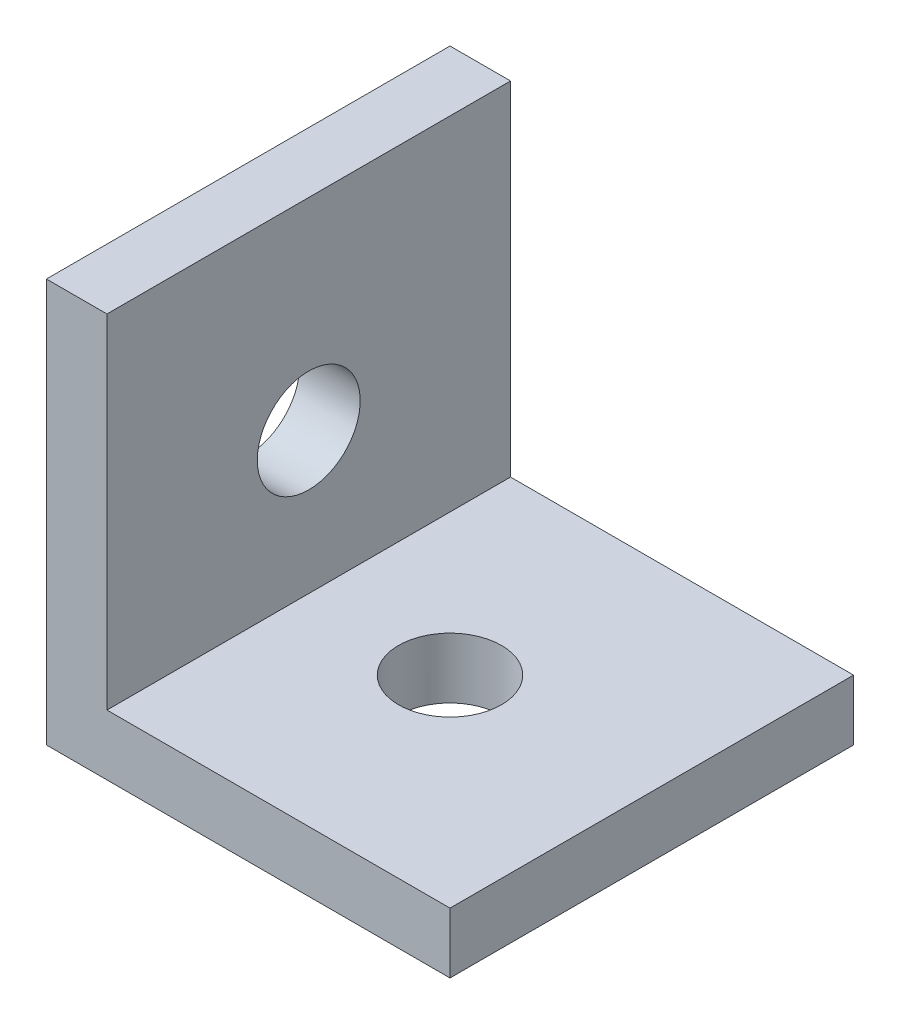
ISO-10303-21;
HEADER;
FILE_DESCRIPTION(('STEP AP214'),'2;1');
FILE_NAME('part.step','',(''),(''),'','','');
FILE_SCHEMA(('AUTOMOTIVE_DESIGN { 1 0 10303 214 1 1 1 1 }'));
ENDSEC;
DATA;
#1=APPLICATION_CONTEXT('core data for automotive mechanical design processes');
#2=APPLICATION_PROTOCOL_DEFINITION('international standard','automotive_design',2000,#1);
#3=PRODUCT_CONTEXT('',#1,'mechanical');
#4=PRODUCT('Part','Part','',(#3));
#5=PRODUCT_RELATED_PRODUCT_CATEGORY('part','',(#4));
#6=PRODUCT_DEFINITION_FORMATION('','',#4);
#7=PRODUCT_DEFINITION_CONTEXT('part definition',#1,'design');
#8=PRODUCT_DEFINITION('design','',#6,#7);
#9=PRODUCT_DEFINITION_SHAPE('','',#8);
#10=(LENGTH_UNIT() NAMED_UNIT(*) SI_UNIT(.MILLI.,.METRE.));
#11=(NAMED_UNIT(*) PLANE_ANGLE_UNIT() SI_UNIT($,.RADIAN.));
#12=(NAMED_UNIT(*) SI_UNIT($,.STERADIAN.) SOLID_ANGLE_UNIT());
#13=UNCERTAINTY_MEASURE_WITH_UNIT(LENGTH_MEASURE(1.E-05),#10,'distance_accuracy_value','');
#14=(GEOMETRIC_REPRESENTATION_CONTEXT(3) GLOBAL_UNCERTAINTY_ASSIGNED_CONTEXT((#13)) GLOBAL_UNIT_ASSIGNED_CONTEXT((#10,
#11,#12)) REPRESENTATION_CONTEXT('',''));
#15=CARTESIAN_POINT('',(0.,0.,0.));
#16=DIRECTION('',(0.,0.,1.));
#17=DIRECTION('',(1.,0.,0.));
#18=AXIS2_PLACEMENT_3D('',#15,#16,#17);
#19=CARTESIAN_POINT('',(0.,20.,20.));
#20=DIRECTION('',(0.,-1.,0.));
#21=DIRECTION('',(0.,0.,-1.));
#22=AXIS2_PLACEMENT_3D('',#19,#20,#21);
#23=PLANE('',#22);
#24=DIRECTION('',(-1.,0.,0.));
#25=VECTOR('',#24,1.);
#26=CARTESIAN_POINT('',(0.,20.,0.));
#27=LINE('',#26,#25);
#28=CARTESIAN_POINT('',(3.,20.,0.));
#29=VERTEX_POINT('',#28);
#30=CARTESIAN_POINT('',(0.,20.,0.));
#31=VERTEX_POINT('',#30);
#32=EDGE_CURVE('E118',#29,#31,#27,.T.);
#33=ORIENTED_EDGE('',*,*,#32,.T.);
#34=DIRECTION('',(0.,0.,-1.));
#35=VECTOR('',#34,1.);
#36=CARTESIAN_POINT('',(0.,20.,20.));
#37=LINE('',#36,#35);
#38=CARTESIAN_POINT('',(0.,20.,20.));
#39=VERTEX_POINT('',#38);
#40=EDGE_CURVE('E11',#39,#31,#37,.T.);
#41=ORIENTED_EDGE('',*,*,#40,.F.);
#42=DIRECTION('',(-1.,0.,0.));
#43=VECTOR('',#42,1.);
#44=CARTESIAN_POINT('',(0.,20.,20.));
#45=LINE('',#44,#43);
#46=CARTESIAN_POINT('',(3.,20.,20.));
#47=VERTEX_POINT('',#46);
#48=EDGE_CURVE('E129',#47,#39,#45,.T.);
#49=ORIENTED_EDGE('',*,*,#48,.F.);
#50=DIRECTION('',(0.,0.,-1.));
#51=VECTOR('',#50,1.);
#52=CARTESIAN_POINT('',(3.,20.,20.));
#53=LINE('',#52,#51);
#54=EDGE_CURVE('E114',#47,#29,#53,.T.);
#55=ORIENTED_EDGE('',*,*,#54,.T.);
#56=EDGE_LOOP('',(#33,#41,#49,#55));
#57=FACE_BOUND('',#56,.T.);
#58=ADVANCED_FACE('F34',(#57),#23,.F.);
#59=CARTESIAN_POINT('',(0.,20.,20.));
#60=DIRECTION('',(1.,0.,0.));
#61=DIRECTION('',(0.,0.,-1.));
#62=AXIS2_PLACEMENT_3D('',#59,#60,#61);
#63=PLANE('',#62);
#64=CARTESIAN_POINT('',(0.,10.,10.));
#65=DIRECTION('',(-1.,0.,0.));
#66=DIRECTION('',(0.,0.,1.));
#67=AXIS2_PLACEMENT_3D('',#64,#65,#66);
#68=CIRCLE('',#67,2.55);
#69=CARTESIAN_POINT('',(0.,10.,12.55));
#70=VERTEX_POINT('',#69);
#71=EDGE_CURVE('E226',#70,#70,#68,.T.);
#72=ORIENTED_EDGE('',*,*,#71,.F.);
#73=EDGE_LOOP('',(#72));
#74=FACE_BOUND('',#73,.T.);
#75=DIRECTION('',(0.,-1.,0.));
#76=VECTOR('',#75,1.);
#77=CARTESIAN_POINT('',(0.,20.,0.));
#78=LINE('',#77,#76);
#79=CARTESIAN_POINT('',(0.,0.,0.));
#80=VERTEX_POINT('',#79);
#81=EDGE_CURVE('E121',#31,#80,#78,.T.);
#82=ORIENTED_EDGE('',*,*,#81,.T.);
#83=DIRECTION('',(0.,0.,-1.));
#84=VECTOR('',#83,1.);
#85=CARTESIAN_POINT('',(0.,0.,20.));
#86=LINE('',#85,#84);
#87=CARTESIAN_POINT('',(0.,0.,20.));
#88=VERTEX_POINT('',#87);
#89=EDGE_CURVE('E42',#88,#80,#86,.T.);
#90=ORIENTED_EDGE('',*,*,#89,.F.);
#91=DIRECTION('',(0.,-1.,0.));
#92=VECTOR('',#91,1.);
#93=CARTESIAN_POINT('',(0.,20.,20.));
#94=LINE('',#93,#92);
#95=EDGE_CURVE('E87',#39,#88,#94,.T.);
#96=ORIENTED_EDGE('',*,*,#95,.F.);
#97=ORIENTED_EDGE('',*,*,#40,.T.);
#98=EDGE_LOOP('',(#82,#90,#96,#97));
#99=FACE_BOUND('',#98,.T.);
#100=ADVANCED_FACE('F158',(#74,#99),#63,.F.);
#101=CARTESIAN_POINT('',(0.,0.,20.));
#102=DIRECTION('',(0.,1.,0.));
#103=DIRECTION('',(0.,0.,1.));
#104=AXIS2_PLACEMENT_3D('',#101,#102,#103);
#105=PLANE('',#104);
#106=CARTESIAN_POINT('',(10.,0.,10.));
#107=DIRECTION('',(0.,-1.,0.));
#108=DIRECTION('',(0.,0.,-1.));
#109=AXIS2_PLACEMENT_3D('',#106,#107,#108);
#110=CIRCLE('',#109,2.55);
#111=CARTESIAN_POINT('',(10.,0.,7.45));
#112=VERTEX_POINT('',#111);
#113=EDGE_CURVE('E222',#112,#112,#110,.T.);
#114=ORIENTED_EDGE('',*,*,#113,.F.);
#115=EDGE_LOOP('',(#114));
#116=FACE_BOUND('',#115,.T.);
#117=DIRECTION('',(1.,0.,0.));
#118=VECTOR('',#117,1.);
#119=CARTESIAN_POINT('',(0.,0.,0.));
#120=LINE('',#119,#118);
#121=CARTESIAN_POINT('',(20.,0.,0.));
#122=VERTEX_POINT('',#121);
#123=EDGE_CURVE('E124',#80,#122,#120,.T.);
#124=ORIENTED_EDGE('',*,*,#123,.T.);
#125=DIRECTION('',(0.,0.,-1.));
#126=VECTOR('',#125,1.);
#127=CARTESIAN_POINT('',(20.,0.,20.));
#128=LINE('',#127,#126);
#129=CARTESIAN_POINT('',(20.,0.,20.));
#130=VERTEX_POINT('',#129);
#131=EDGE_CURVE('E109',#130,#122,#128,.T.);
#132=ORIENTED_EDGE('',*,*,#131,.F.);
#133=DIRECTION('',(1.,0.,0.));
#134=VECTOR('',#133,1.);
#135=CARTESIAN_POINT('',(0.,0.,20.));
#136=LINE('',#135,#134);
#137=EDGE_CURVE('E100',#88,#130,#136,.T.);
#138=ORIENTED_EDGE('',*,*,#137,.F.);
#139=ORIENTED_EDGE('',*,*,#89,.T.);
#140=EDGE_LOOP('',(#124,#132,#138,#139));
#141=FACE_BOUND('',#140,.T.);
#142=ADVANCED_FACE('F135',(#116,#141),#105,.F.);
#143=CARTESIAN_POINT('',(20.,3.,20.));
#144=DIRECTION('',(-1.,0.,0.));
#145=DIRECTION('',(0.,0.,1.));
#146=AXIS2_PLACEMENT_3D('',#143,#144,#145);
#147=PLANE('',#146);
#148=DIRECTION('',(0.,1.,0.));
#149=VECTOR('',#148,1.);
#150=CARTESIAN_POINT('',(20.,3.,0.));
#151=LINE('',#150,#149);
#152=CARTESIAN_POINT('',(20.,3.,0.));
#153=VERTEX_POINT('',#152);
#154=EDGE_CURVE('E108',#122,#153,#151,.T.);
#155=ORIENTED_EDGE('',*,*,#154,.T.);
#156=DIRECTION('',(0.,0.,-1.));
#157=VECTOR('',#156,1.);
#158=CARTESIAN_POINT('',(20.,3.,20.));
#159=LINE('',#158,#157);
#160=CARTESIAN_POINT('',(20.,3.,20.));
#161=VERTEX_POINT('',#160);
#162=EDGE_CURVE('E105',#161,#153,#159,.T.);
#163=ORIENTED_EDGE('',*,*,#162,.F.);
#164=DIRECTION('',(0.,1.,0.));
#165=VECTOR('',#164,1.);
#166=CARTESIAN_POINT('',(20.,3.,20.));
#167=LINE('',#166,#165);
#168=EDGE_CURVE('E94',#130,#161,#167,.T.);
#169=ORIENTED_EDGE('',*,*,#168,.F.);
#170=ORIENTED_EDGE('',*,*,#131,.T.);
#171=EDGE_LOOP('',(#155,#163,#169,#170));
#172=FACE_BOUND('',#171,.T.);
#173=ADVANCED_FACE('F106',(#172),#147,.F.);
#174=CARTESIAN_POINT('',(3.,3.,20.));
#175=DIRECTION('',(0.,-1.,0.));
#176=DIRECTION('',(1.,0.,0.));
#177=AXIS2_PLACEMENT_3D('',#174,#175,#176);
#178=PLANE('',#177);
#179=CARTESIAN_POINT('',(10.,3.,10.));
#180=DIRECTION('',(0.,-1.,0.));
#181=DIRECTION('',(1.,0.,0.));
#182=AXIS2_PLACEMENT_3D('',#179,#180,#181);
#183=CIRCLE('',#182,2.55);
#184=CARTESIAN_POINT('',(12.55,3.,10.));
#185=VERTEX_POINT('',#184);
#186=EDGE_CURVE('E225',#185,#185,#183,.F.);
#187=ORIENTED_EDGE('',*,*,#186,.F.);
#188=EDGE_LOOP('',(#187));
#189=FACE_BOUND('',#188,.T.);
#190=DIRECTION('',(-1.,0.,0.));
#191=VECTOR('',#190,1.);
#192=CARTESIAN_POINT('',(3.,3.,0.));
#193=LINE('',#192,#191);
#194=CARTESIAN_POINT('',(3.,3.,0.));
#195=VERTEX_POINT('',#194);
#196=EDGE_CURVE('E73',#153,#195,#193,.T.);
#197=ORIENTED_EDGE('',*,*,#196,.T.);
#198=DIRECTION('',(0.,0.,-1.));
#199=VECTOR('',#198,1.);
#200=CARTESIAN_POINT('',(3.,3.,20.));
#201=LINE('',#200,#199);
#202=CARTESIAN_POINT('',(3.,3.,20.));
#203=VERTEX_POINT('',#202);
#204=EDGE_CURVE('E110',#203,#195,#201,.T.);
#205=ORIENTED_EDGE('',*,*,#204,.F.);
#206=DIRECTION('',(-1.,0.,0.));
#207=VECTOR('',#206,1.);
#208=CARTESIAN_POINT('',(3.,3.,20.));
#209=LINE('',#208,#207);
#210=EDGE_CURVE('E98',#161,#203,#209,.T.);
#211=ORIENTED_EDGE('',*,*,#210,.F.);
#212=ORIENTED_EDGE('',*,*,#162,.T.);
#213=EDGE_LOOP('',(#197,#205,#211,#212));
#214=FACE_BOUND('',#213,.T.);
#215=ADVANCED_FACE('F112',(#189,#214),#178,.F.);
#216=CARTESIAN_POINT('',(3.,20.,20.));
#217=DIRECTION('',(-1.,0.,0.));
#218=DIRECTION('',(0.,-1.,0.));
#219=AXIS2_PLACEMENT_3D('',#216,#217,#218);
#220=PLANE('',#219);
#221=CARTESIAN_POINT('',(3.,10.,10.));
#222=DIRECTION('',(-1.,0.,0.));
#223=DIRECTION('',(0.,-1.,0.));
#224=AXIS2_PLACEMENT_3D('',#221,#222,#223);
#225=CIRCLE('',#224,2.55);
#226=CARTESIAN_POINT('',(3.,7.45,10.));
#227=VERTEX_POINT('',#226);
#228=EDGE_CURVE('E122',#227,#227,#225,.F.);
#229=ORIENTED_EDGE('',*,*,#228,.F.);
#230=EDGE_LOOP('',(#229));
#231=FACE_BOUND('',#230,.T.);
#232=DIRECTION('',(0.,1.,0.));
#233=VECTOR('',#232,1.);
#234=CARTESIAN_POINT('',(3.,20.,0.));
#235=LINE('',#234,#233);
#236=EDGE_CURVE('E79',#195,#29,#235,.T.);
#237=ORIENTED_EDGE('',*,*,#236,.T.);
#238=ORIENTED_EDGE('',*,*,#54,.F.);
#239=DIRECTION('',(0.,1.,0.));
#240=VECTOR('',#239,1.);
#241=CARTESIAN_POINT('',(3.,20.,20.));
#242=LINE('',#241,#240);
#243=EDGE_CURVE('E50',#203,#47,#242,.T.);
#244=ORIENTED_EDGE('',*,*,#243,.F.);
#245=ORIENTED_EDGE('',*,*,#204,.T.);
#246=EDGE_LOOP('',(#237,#238,#244,#245));
#247=FACE_BOUND('',#246,.T.);
#248=ADVANCED_FACE('F142',(#231,#247),#220,.F.);
#249=CARTESIAN_POINT('',(0.,0.,20.));
#250=DIRECTION('',(0.,0.,-1.));
#251=DIRECTION('',(-1.,0.,0.));
#252=AXIS2_PLACEMENT_3D('',#249,#250,#251);
#253=PLANE('',#252);
#254=ORIENTED_EDGE('',*,*,#48,.T.);
#255=ORIENTED_EDGE('',*,*,#95,.T.);
#256=ORIENTED_EDGE('',*,*,#137,.T.);
#257=ORIENTED_EDGE('',*,*,#168,.T.);
#258=ORIENTED_EDGE('',*,*,#210,.T.);
#259=ORIENTED_EDGE('',*,*,#243,.T.);
#260=EDGE_LOOP('',(#254,#255,#256,#257,#258,#259));
#261=FACE_BOUND('',#260,.T.);
#262=ADVANCED_FACE('F96',(#261),#253,.F.);
#263=CARTESIAN_POINT('',(0.,0.,0.));
#264=DIRECTION('',(0.,0.,-1.));
#265=DIRECTION('',(-1.,0.,0.));
#266=AXIS2_PLACEMENT_3D('',#263,#264,#265);
#267=PLANE('',#266);
#268=ORIENTED_EDGE('',*,*,#32,.F.);
#269=ORIENTED_EDGE('',*,*,#236,.F.);
#270=ORIENTED_EDGE('',*,*,#196,.F.);
#271=ORIENTED_EDGE('',*,*,#154,.F.);
#272=ORIENTED_EDGE('',*,*,#123,.F.);
#273=ORIENTED_EDGE('',*,*,#81,.F.);
#274=EDGE_LOOP('',(#268,#269,#270,#271,#272,#273));
#275=FACE_BOUND('',#274,.T.);
#276=ADVANCED_FACE('F138',(#275),#267,.T.);
#277=CARTESIAN_POINT('',(20.001,10.,10.));
#278=DIRECTION('',(-1.,0.,0.));
#279=DIRECTION('',(0.,0.,1.));
#280=AXIS2_PLACEMENT_3D('',#277,#278,#279);
#281=CYLINDRICAL_SURFACE('',#280,2.55);
#282=ORIENTED_EDGE('',*,*,#71,.T.);
#283=EDGE_LOOP('',(#282));
#284=FACE_BOUND('',#283,.T.);
#285=ORIENTED_EDGE('',*,*,#228,.T.);
#286=EDGE_LOOP('',(#285));
#287=FACE_BOUND('',#286,.T.);
#288=ADVANCED_FACE('F196',(#284,#287),#281,.F.);
#289=CARTESIAN_POINT('',(10.,20.001,10.));
#290=DIRECTION('',(0.,-1.,0.));
#291=DIRECTION('',(0.,0.,-1.));
#292=AXIS2_PLACEMENT_3D('',#289,#290,#291);
#293=CYLINDRICAL_SURFACE('',#292,2.55);
#294=ORIENTED_EDGE('',*,*,#113,.T.);
#295=EDGE_LOOP('',(#294));
#296=FACE_BOUND('',#295,.T.);
#297=ORIENTED_EDGE('',*,*,#186,.T.);
#298=EDGE_LOOP('',(#297));
#299=FACE_BOUND('',#298,.T.);
#300=ADVANCED_FACE('F201',(#296,#299),#293,.F.);
#301=CLOSED_SHELL('',(#58,#100,#142,#173,#215,#248,#262,#276,#288,#300));
#302=MANIFOLD_SOLID_BREP('B2',#301);
#303=ADVANCED_BREP_SHAPE_REPRESENTATION('',(#18,#302),#14);
#304=SHAPE_DEFINITION_REPRESENTATION(#9,#303);
ENDSEC;
END-ISO-10303-21;
